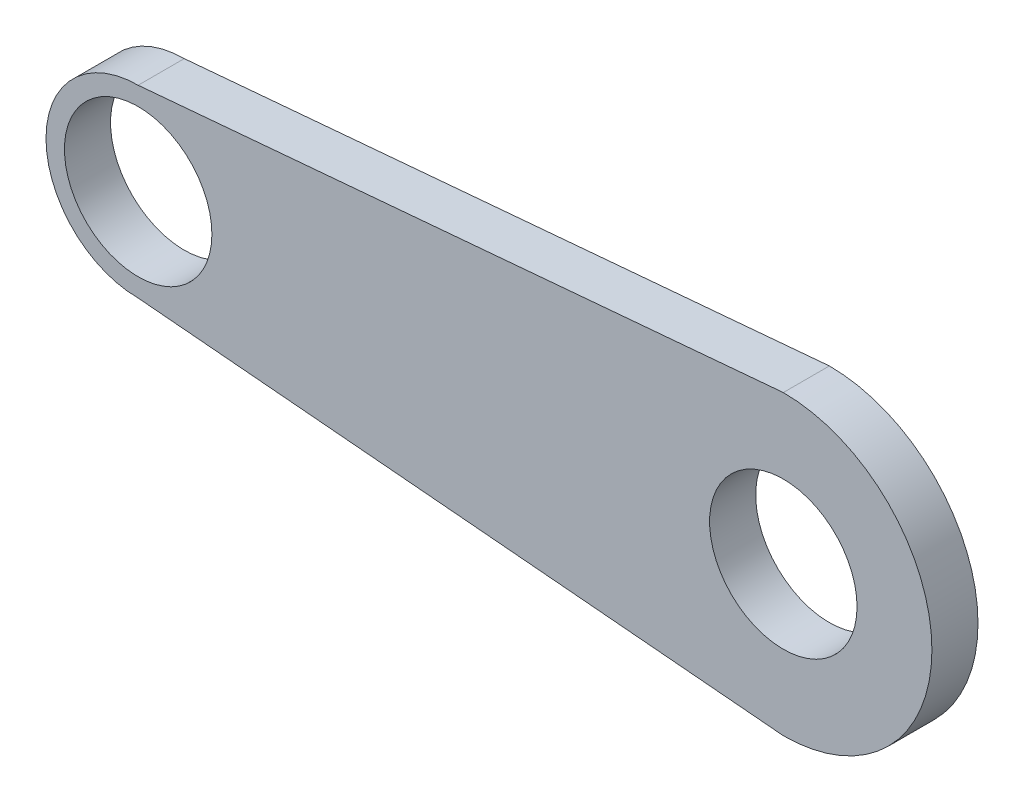
ISO-10303-21;
HEADER;
FILE_DESCRIPTION(('STEP AP214'),'2;1');
FILE_NAME('part.step','',(''),(''),'','','');
FILE_SCHEMA(('AUTOMOTIVE_DESIGN { 1 0 10303 214 1 1 1 1 }'));
ENDSEC;
DATA;
#1=APPLICATION_CONTEXT('core data for automotive mechanical design processes');
#2=APPLICATION_PROTOCOL_DEFINITION('international standard','automotive_design',2000,#1);
#3=PRODUCT_CONTEXT('',#1,'mechanical');
#4=PRODUCT('Part','Part','',(#3));
#5=PRODUCT_RELATED_PRODUCT_CATEGORY('part','',(#4));
#6=PRODUCT_DEFINITION_FORMATION('','',#4);
#7=PRODUCT_DEFINITION_CONTEXT('part definition',#1,'design');
#8=PRODUCT_DEFINITION('design','',#6,#7);
#9=PRODUCT_DEFINITION_SHAPE('','',#8);
#10=(LENGTH_UNIT() NAMED_UNIT(*) SI_UNIT(.MILLI.,.METRE.));
#11=(NAMED_UNIT(*) PLANE_ANGLE_UNIT() SI_UNIT($,.RADIAN.));
#12=(NAMED_UNIT(*) SI_UNIT($,.STERADIAN.) SOLID_ANGLE_UNIT());
#13=UNCERTAINTY_MEASURE_WITH_UNIT(LENGTH_MEASURE(1.E-05),#10,'distance_accuracy_value','');
#14=(GEOMETRIC_REPRESENTATION_CONTEXT(3) GLOBAL_UNCERTAINTY_ASSIGNED_CONTEXT((#13)) GLOBAL_UNIT_ASSIGNED_CONTEXT((#10,
#11,#12)) REPRESENTATION_CONTEXT('',''));
#15=CARTESIAN_POINT('',(0.,0.,0.));
#16=DIRECTION('',(0.,0.,1.));
#17=DIRECTION('',(1.,0.,0.));
#18=AXIS2_PLACEMENT_3D('',#15,#16,#17);
#19=CARTESIAN_POINT('',(-0.399356705032833,4.5646680259837,12.7));
#20=DIRECTION('',(-0.0871557427476584,0.996194698091746,0.));
#21=DIRECTION('',(-0.996194698091746,-0.0871557427476584,0.));
#22=AXIS2_PLACEMENT_3D('',#19,#20,#21);
#23=PLANE('',#22);
#24=DIRECTION('',(0.996194698091746,0.0871557427476584,0.));
#25=VECTOR('',#24,1.);
#26=CARTESIAN_POINT('',(-0.399356705032833,4.5646680259837,0.));
#27=LINE('',#26,#25);
#28=CARTESIAN_POINT('',(-133.278879175431,-7.06078380491441,0.));
#29=VERTEX_POINT('',#28);
#30=CARTESIAN_POINT('',(44.5211208245695,8.49470056999492,0.));
#31=VERTEX_POINT('',#30);
#32=EDGE_CURVE('E106',#29,#31,#27,.T.);
#33=ORIENTED_EDGE('',*,*,#32,.F.);
#34=DIRECTION('',(0.,0.,-1.));
#35=VECTOR('',#34,1.);
#36=CARTESIAN_POINT('',(-133.278879175431,-7.06078380491441,12.7));
#37=LINE('',#36,#35);
#38=CARTESIAN_POINT('',(-133.278879175431,-7.06078380491441,12.7));
#39=VERTEX_POINT('',#38);
#40=EDGE_CURVE('E11',#39,#29,#37,.T.);
#41=ORIENTED_EDGE('',*,*,#40,.F.);
#42=DIRECTION('',(0.996194698091746,0.0871557427476584,0.));
#43=VECTOR('',#42,1.);
#44=CARTESIAN_POINT('',(-0.399356705032833,4.5646680259837,12.7));
#45=LINE('',#44,#43);
#46=CARTESIAN_POINT('',(44.5211208245695,8.49470056999492,12.7));
#47=VERTEX_POINT('',#46);
#48=EDGE_CURVE('E92',#39,#47,#45,.T.);
#49=ORIENTED_EDGE('',*,*,#48,.T.);
#50=DIRECTION('',(0.,0.,-1.));
#51=VECTOR('',#50,1.);
#52=CARTESIAN_POINT('',(44.5211208245695,8.49470056999492,12.7));
#53=LINE('',#52,#51);
#54=EDGE_CURVE('E74',#47,#31,#53,.T.);
#55=ORIENTED_EDGE('',*,*,#54,.T.);
#56=EDGE_LOOP('',(#33,#41,#49,#55));
#57=FACE_BOUND('',#56,.T.);
#58=ADVANCED_FACE('F35',(#57),#23,.T.);
#59=CARTESIAN_POINT('',(-133.278879175431,-32.4607838049144,12.7));
#60=DIRECTION('',(0.,0.,-1.));
#61=DIRECTION('',(-1.,0.,0.));
#62=AXIS2_PLACEMENT_3D('',#59,#60,#61);
#63=CYLINDRICAL_SURFACE('',#62,25.4);
#64=CARTESIAN_POINT('',(-133.278879175431,-32.4607838049144,0.));
#65=DIRECTION('',(0.,0.,1.));
#66=DIRECTION('',(1.,0.,0.));
#67=AXIS2_PLACEMENT_3D('',#64,#65,#66);
#68=CIRCLE('',#67,25.4);
#69=CARTESIAN_POINT('',(-133.278879175431,-57.8607838049144,0.));
#70=VERTEX_POINT('',#69);
#71=EDGE_CURVE('E97',#29,#70,#68,.T.);
#72=ORIENTED_EDGE('',*,*,#71,.T.);
#73=DIRECTION('',(0.,0.,-1.));
#74=VECTOR('',#73,1.);
#75=CARTESIAN_POINT('',(-133.278879175431,-57.8607838049144,12.7));
#76=LINE('',#75,#74);
#77=CARTESIAN_POINT('',(-133.278879175431,-57.8607838049144,12.7));
#78=VERTEX_POINT('',#77);
#79=EDGE_CURVE('E44',#78,#70,#76,.T.);
#80=ORIENTED_EDGE('',*,*,#79,.F.);
#81=CARTESIAN_POINT('',(-133.278879175431,-32.4607838049144,12.7));
#82=DIRECTION('',(0.,0.,1.));
#83=DIRECTION('',(1.,0.,0.));
#84=AXIS2_PLACEMENT_3D('',#81,#82,#83);
#85=CIRCLE('',#84,25.4);
#86=EDGE_CURVE('E89',#39,#78,#85,.T.);
#87=ORIENTED_EDGE('',*,*,#86,.F.);
#88=ORIENTED_EDGE('',*,*,#40,.T.);
#89=EDGE_LOOP('',(#72,#80,#87,#88));
#90=FACE_BOUND('',#89,.T.);
#91=ADVANCED_FACE('F95',(#90),#63,.T.);
#92=CARTESIAN_POINT('',(-6.03611265839643,-68.9930833908309,12.7));
#93=DIRECTION('',(0.0871557427476583,0.996194698091746,0.));
#94=DIRECTION('',(-0.996194698091746,0.0871557427476583,0.));
#95=AXIS2_PLACEMENT_3D('',#92,#93,#94);
#96=PLANE('',#95);
#97=DIRECTION('',(0.996194698091746,-0.0871557427476583,0.));
#98=VECTOR('',#97,1.);
#99=CARTESIAN_POINT('',(-6.03611265839643,-68.9930833908309,0.));
#100=LINE('',#99,#98);
#101=CARTESIAN_POINT('',(44.5211208245695,-73.4162681798237,0.));
#102=VERTEX_POINT('',#101);
#103=EDGE_CURVE('E103',#70,#102,#100,.T.);
#104=ORIENTED_EDGE('',*,*,#103,.T.);
#105=DIRECTION('',(0.,0.,-1.));
#106=VECTOR('',#105,1.);
#107=CARTESIAN_POINT('',(44.5211208245695,-73.4162681798237,12.7));
#108=LINE('',#107,#106);
#109=CARTESIAN_POINT('',(44.5211208245695,-73.4162681798237,12.7));
#110=VERTEX_POINT('',#109);
#111=EDGE_CURVE('E88',#110,#102,#108,.T.);
#112=ORIENTED_EDGE('',*,*,#111,.F.);
#113=DIRECTION('',(0.996194698091746,-0.0871557427476583,0.));
#114=VECTOR('',#113,1.);
#115=CARTESIAN_POINT('',(-6.03611265839643,-68.9930833908309,12.7));
#116=LINE('',#115,#114);
#117=EDGE_CURVE('E82',#78,#110,#116,.T.);
#118=ORIENTED_EDGE('',*,*,#117,.F.);
#119=ORIENTED_EDGE('',*,*,#79,.T.);
#120=EDGE_LOOP('',(#104,#112,#118,#119));
#121=FACE_BOUND('',#120,.T.);
#122=ADVANCED_FACE('F85',(#121),#96,.F.);
#123=CARTESIAN_POINT('',(-133.278879175431,-32.4607838049144,12.7));
#124=DIRECTION('',(0.,0.,-1.));
#125=DIRECTION('',(-1.,0.,0.));
#126=AXIS2_PLACEMENT_3D('',#123,#124,#125);
#127=CYLINDRICAL_SURFACE('',#126,20.32);
#128=CARTESIAN_POINT('',(-133.278879175431,-32.4607838049144,12.7));
#129=DIRECTION('',(0.,0.,1.));
#130=DIRECTION('',(1.,0.,0.));
#131=AXIS2_PLACEMENT_3D('',#128,#129,#130);
#132=CIRCLE('',#131,20.32);
#133=CARTESIAN_POINT('',(-112.958879175431,-32.4607838049144,12.7));
#134=VERTEX_POINT('',#133);
#135=EDGE_CURVE('E116',#134,#134,#132,.T.);
#136=ORIENTED_EDGE('',*,*,#135,.T.);
#137=EDGE_LOOP('',(#136));
#138=FACE_BOUND('',#137,.T.);
#139=CARTESIAN_POINT('',(-133.278879175431,-32.4607838049144,0.));
#140=DIRECTION('',(0.,0.,1.));
#141=DIRECTION('',(1.,0.,0.));
#142=AXIS2_PLACEMENT_3D('',#139,#140,#141);
#143=CIRCLE('',#142,20.32);
#144=CARTESIAN_POINT('',(-112.958879175431,-32.4607838049144,0.));
#145=VERTEX_POINT('',#144);
#146=EDGE_CURVE('E108',#145,#145,#143,.T.);
#147=ORIENTED_EDGE('',*,*,#146,.F.);
#148=EDGE_LOOP('',(#147));
#149=FACE_BOUND('',#148,.T.);
#150=ADVANCED_FACE('F131',(#138,#149),#127,.F.);
#151=CARTESIAN_POINT('',(44.5211208245695,-32.4607838049144,12.7));
#152=DIRECTION('',(0.,0.,-1.));
#153=DIRECTION('',(-1.,0.,0.));
#154=AXIS2_PLACEMENT_3D('',#151,#152,#153);
#155=CYLINDRICAL_SURFACE('',#154,20.32);
#156=CARTESIAN_POINT('',(44.5211208245695,-32.4607838049144,12.7));
#157=DIRECTION('',(0.,0.,1.));
#158=DIRECTION('',(1.,0.,0.));
#159=AXIS2_PLACEMENT_3D('',#156,#157,#158);
#160=CIRCLE('',#159,20.32);
#161=CARTESIAN_POINT('',(64.8411208245695,-32.4607838049144,12.7));
#162=VERTEX_POINT('',#161);
#163=EDGE_CURVE('E102',#162,#162,#160,.T.);
#164=ORIENTED_EDGE('',*,*,#163,.T.);
#165=EDGE_LOOP('',(#164));
#166=FACE_BOUND('',#165,.T.);
#167=CARTESIAN_POINT('',(44.5211208245695,-32.4607838049144,0.));
#168=DIRECTION('',(0.,0.,1.));
#169=DIRECTION('',(1.,0.,0.));
#170=AXIS2_PLACEMENT_3D('',#167,#168,#169);
#171=CIRCLE('',#170,20.32);
#172=CARTESIAN_POINT('',(64.8411208245695,-32.4607838049144,0.));
#173=VERTEX_POINT('',#172);
#174=EDGE_CURVE('E111',#173,#173,#171,.T.);
#175=ORIENTED_EDGE('',*,*,#174,.F.);
#176=EDGE_LOOP('',(#175));
#177=FACE_BOUND('',#176,.T.);
#178=ADVANCED_FACE('F37',(#166,#177),#155,.F.);
#179=CARTESIAN_POINT('',(44.5211208245695,-32.4607838049144,12.7));
#180=DIRECTION('',(0.,0.,-1.));
#181=DIRECTION('',(-1.,0.,0.));
#182=AXIS2_PLACEMENT_3D('',#179,#180,#181);
#183=CYLINDRICAL_SURFACE('',#182,40.9554843749093);
#184=CARTESIAN_POINT('',(44.5211208245695,-32.4607838049144,0.));
#185=DIRECTION('',(0.,0.,1.));
#186=DIRECTION('',(1.,0.,0.));
#187=AXIS2_PLACEMENT_3D('',#184,#185,#186);
#188=CIRCLE('',#187,40.9554843749093);
#189=EDGE_CURVE('E67',#102,#31,#188,.T.);
#190=ORIENTED_EDGE('',*,*,#189,.T.);
#191=ORIENTED_EDGE('',*,*,#54,.F.);
#192=CARTESIAN_POINT('',(44.5211208245695,-32.4607838049144,12.7));
#193=DIRECTION('',(0.,0.,1.));
#194=DIRECTION('',(1.,0.,0.));
#195=AXIS2_PLACEMENT_3D('',#192,#193,#194);
#196=CIRCLE('',#195,40.9554843749093);
#197=EDGE_CURVE('E52',#110,#47,#196,.T.);
#198=ORIENTED_EDGE('',*,*,#197,.F.);
#199=ORIENTED_EDGE('',*,*,#111,.T.);
#200=EDGE_LOOP('',(#190,#191,#198,#199));
#201=FACE_BOUND('',#200,.T.);
#202=ADVANCED_FACE('F127',(#201),#183,.T.);
#203=CARTESIAN_POINT('',(0.,0.,12.7));
#204=DIRECTION('',(0.,0.,1.));
#205=DIRECTION('',(1.,0.,0.));
#206=AXIS2_PLACEMENT_3D('',#203,#204,#205);
#207=PLANE('',#206);
#208=ORIENTED_EDGE('',*,*,#163,.F.);
#209=EDGE_LOOP('',(#208));
#210=FACE_BOUND('',#209,.T.);
#211=ORIENTED_EDGE('',*,*,#135,.F.);
#212=EDGE_LOOP('',(#211));
#213=FACE_BOUND('',#212,.T.);
#214=ORIENTED_EDGE('',*,*,#48,.F.);
#215=ORIENTED_EDGE('',*,*,#86,.T.);
#216=ORIENTED_EDGE('',*,*,#117,.T.);
#217=ORIENTED_EDGE('',*,*,#197,.T.);
#218=EDGE_LOOP('',(#214,#215,#216,#217));
#219=FACE_BOUND('',#218,.T.);
#220=ADVANCED_FACE('F91',(#210,#213,#219),#207,.T.);
#221=CARTESIAN_POINT('',(0.,0.,0.));
#222=DIRECTION('',(0.,0.,1.));
#223=DIRECTION('',(1.,0.,0.));
#224=AXIS2_PLACEMENT_3D('',#221,#222,#223);
#225=PLANE('',#224);
#226=ORIENTED_EDGE('',*,*,#174,.T.);
#227=EDGE_LOOP('',(#226));
#228=FACE_BOUND('',#227,.T.);
#229=ORIENTED_EDGE('',*,*,#146,.T.);
#230=EDGE_LOOP('',(#229));
#231=FACE_BOUND('',#230,.T.);
#232=ORIENTED_EDGE('',*,*,#32,.T.);
#233=ORIENTED_EDGE('',*,*,#189,.F.);
#234=ORIENTED_EDGE('',*,*,#103,.F.);
#235=ORIENTED_EDGE('',*,*,#71,.F.);
#236=EDGE_LOOP('',(#232,#233,#234,#235));
#237=FACE_BOUND('',#236,.T.);
#238=ADVANCED_FACE('F126',(#228,#231,#237),#225,.F.);
#239=CLOSED_SHELL('',(#58,#91,#122,#150,#178,#202,#220,#238));
#240=MANIFOLD_SOLID_BREP('B2',#239);
#241=ADVANCED_BREP_SHAPE_REPRESENTATION('',(#18,#240),#14);
#242=SHAPE_DEFINITION_REPRESENTATION(#9,#241);
ENDSEC;
END-ISO-10303-21;
